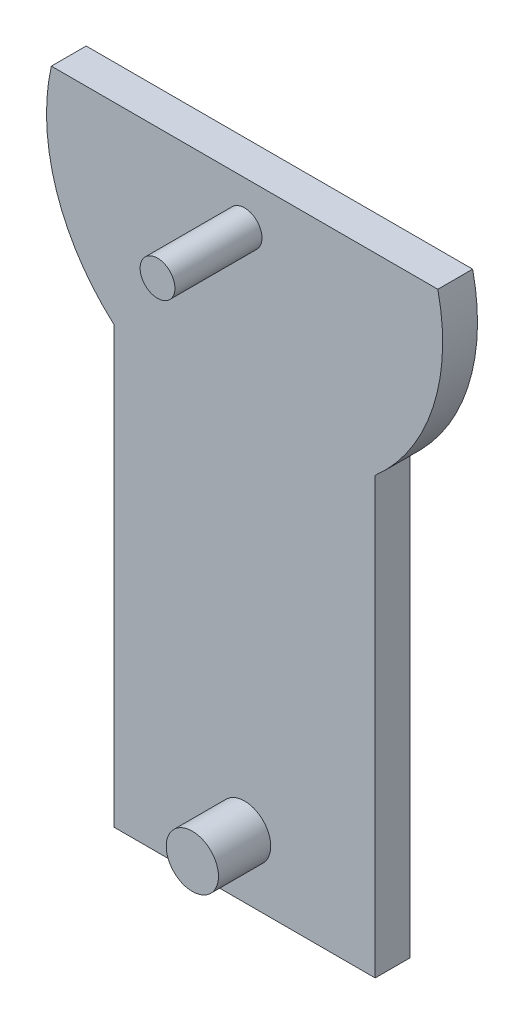
ISO-10303-21;
HEADER;
FILE_DESCRIPTION(('STEP AP214'),'2;1');
FILE_NAME('part.step','',(''),(''),'','','');
FILE_SCHEMA(('AUTOMOTIVE_DESIGN { 1 0 10303 214 1 1 1 1 }'));
ENDSEC;
DATA;
#1=APPLICATION_CONTEXT('core data for automotive mechanical design processes');
#2=APPLICATION_PROTOCOL_DEFINITION('international standard','automotive_design',2000,#1);
#3=PRODUCT_CONTEXT('',#1,'mechanical');
#4=PRODUCT('Part','Part','',(#3));
#5=PRODUCT_RELATED_PRODUCT_CATEGORY('part','',(#4));
#6=PRODUCT_DEFINITION_FORMATION('','',#4);
#7=PRODUCT_DEFINITION_CONTEXT('part definition',#1,'design');
#8=PRODUCT_DEFINITION('design','',#6,#7);
#9=PRODUCT_DEFINITION_SHAPE('','',#8);
#10=(LENGTH_UNIT() NAMED_UNIT(*) SI_UNIT(.MILLI.,.METRE.));
#11=(NAMED_UNIT(*) PLANE_ANGLE_UNIT() SI_UNIT($,.RADIAN.));
#12=(NAMED_UNIT(*) SI_UNIT($,.STERADIAN.) SOLID_ANGLE_UNIT());
#13=UNCERTAINTY_MEASURE_WITH_UNIT(LENGTH_MEASURE(1.E-05),#10,'distance_accuracy_value','');
#14=(GEOMETRIC_REPRESENTATION_CONTEXT(3) GLOBAL_UNCERTAINTY_ASSIGNED_CONTEXT((#13)) GLOBAL_UNIT_ASSIGNED_CONTEXT((#10,
#11,#12)) REPRESENTATION_CONTEXT('',''));
#15=CARTESIAN_POINT('',(0.,0.,0.));
#16=DIRECTION('',(0.,0.,1.));
#17=DIRECTION('',(1.,0.,0.));
#18=AXIS2_PLACEMENT_3D('',#15,#16,#17);
#19=CARTESIAN_POINT('',(75.,0.,20.));
#20=DIRECTION('',(-1.,0.,0.));
#21=DIRECTION('',(0.,-1.,0.));
#22=AXIS2_PLACEMENT_3D('',#19,#20,#21);
#23=PLANE('',#22);
#24=DIRECTION('',(0.,1.,0.));
#25=VECTOR('',#24,1.);
#26=CARTESIAN_POINT('',(75.,0.,0.));
#27=LINE('',#26,#25);
#28=CARTESIAN_POINT('',(75.,-335.522292415487,0.));
#29=VERTEX_POINT('',#28);
#30=CARTESIAN_POINT('',(75.,-85.5222924154866,0.));
#31=VERTEX_POINT('',#30);
#32=EDGE_CURVE('E121',#29,#31,#27,.T.);
#33=ORIENTED_EDGE('',*,*,#32,.T.);
#34=DIRECTION('',(0.,0.,-1.));
#35=VECTOR('',#34,1.);
#36=CARTESIAN_POINT('',(75.,-85.5222924154866,20.));
#37=LINE('',#36,#35);
#38=CARTESIAN_POINT('',(75.,-85.5222924154866,20.));
#39=VERTEX_POINT('',#38);
#40=EDGE_CURVE('E11',#39,#31,#37,.T.);
#41=ORIENTED_EDGE('',*,*,#40,.F.);
#42=DIRECTION('',(0.,1.,0.));
#43=VECTOR('',#42,1.);
#44=CARTESIAN_POINT('',(75.,0.,20.));
#45=LINE('',#44,#43);
#46=CARTESIAN_POINT('',(75.,-335.522292415487,20.));
#47=VERTEX_POINT('',#46);
#48=EDGE_CURVE('E136',#47,#39,#45,.T.);
#49=ORIENTED_EDGE('',*,*,#48,.F.);
#50=DIRECTION('',(0.,0.,-1.));
#51=VECTOR('',#50,1.);
#52=CARTESIAN_POINT('',(75.,-335.522292415487,20.));
#53=LINE('',#52,#51);
#54=EDGE_CURVE('E53',#47,#29,#53,.T.);
#55=ORIENTED_EDGE('',*,*,#54,.T.);
#56=EDGE_LOOP('',(#33,#41,#49,#55));
#57=FACE_BOUND('',#56,.T.);
#58=ADVANCED_FACE('F37',(#57),#23,.F.);
#59=CARTESIAN_POINT('',(0.,0.,20.));
#60=DIRECTION('',(0.,0.,-1.));
#61=DIRECTION('',(-1.,0.,0.));
#62=AXIS2_PLACEMENT_3D('',#59,#60,#61);
#63=CYLINDRICAL_SURFACE('',#62,113.75);
#64=CARTESIAN_POINT('',(0.,0.,0.));
#65=DIRECTION('',(0.,0.,1.));
#66=DIRECTION('',(1.,0.,0.));
#67=AXIS2_PLACEMENT_3D('',#64,#65,#66);
#68=CIRCLE('',#67,113.75);
#69=CARTESIAN_POINT('',(110.968745599831,25.,0.));
#70=VERTEX_POINT('',#69);
#71=EDGE_CURVE('E123',#31,#70,#68,.T.);
#72=ORIENTED_EDGE('',*,*,#71,.T.);
#73=DIRECTION('',(0.,0.,-1.));
#74=VECTOR('',#73,1.);
#75=CARTESIAN_POINT('',(110.968745599831,25.,20.));
#76=LINE('',#75,#74);
#77=CARTESIAN_POINT('',(110.968745599831,25.,20.));
#78=VERTEX_POINT('',#77);
#79=EDGE_CURVE('E45',#78,#70,#76,.T.);
#80=ORIENTED_EDGE('',*,*,#79,.F.);
#81=CARTESIAN_POINT('',(0.,0.,20.));
#82=DIRECTION('',(0.,0.,1.));
#83=DIRECTION('',(1.,0.,0.));
#84=AXIS2_PLACEMENT_3D('',#81,#82,#83);
#85=CIRCLE('',#84,113.75);
#86=EDGE_CURVE('E85',#39,#78,#85,.T.);
#87=ORIENTED_EDGE('',*,*,#86,.F.);
#88=ORIENTED_EDGE('',*,*,#40,.T.);
#89=EDGE_LOOP('',(#72,#80,#87,#88));
#90=FACE_BOUND('',#89,.T.);
#91=ADVANCED_FACE('F142',(#90),#63,.T.);
#92=CARTESIAN_POINT('',(0.,25.,20.));
#93=DIRECTION('',(0.,1.,0.));
#94=DIRECTION('',(-1.,0.,0.));
#95=AXIS2_PLACEMENT_3D('',#92,#93,#94);
#96=PLANE('',#95);
#97=DIRECTION('',(1.,0.,0.));
#98=VECTOR('',#97,1.);
#99=CARTESIAN_POINT('',(0.,25.,0.));
#100=LINE('',#99,#98);
#101=CARTESIAN_POINT('',(-110.968745599831,25.,0.));
#102=VERTEX_POINT('',#101);
#103=EDGE_CURVE('E127',#102,#70,#100,.T.);
#104=ORIENTED_EDGE('',*,*,#103,.F.);
#105=DIRECTION('',(0.,0.,-1.));
#106=VECTOR('',#105,1.);
#107=CARTESIAN_POINT('',(-110.968745599831,25.,20.));
#108=LINE('',#107,#106);
#109=CARTESIAN_POINT('',(-110.968745599831,25.,20.));
#110=VERTEX_POINT('',#109);
#111=EDGE_CURVE('E113',#110,#102,#108,.T.);
#112=ORIENTED_EDGE('',*,*,#111,.F.);
#113=DIRECTION('',(1.,0.,0.));
#114=VECTOR('',#113,1.);
#115=CARTESIAN_POINT('',(0.,25.,20.));
#116=LINE('',#115,#114);
#117=EDGE_CURVE('E103',#110,#78,#116,.T.);
#118=ORIENTED_EDGE('',*,*,#117,.T.);
#119=ORIENTED_EDGE('',*,*,#79,.T.);
#120=EDGE_LOOP('',(#104,#112,#118,#119));
#121=FACE_BOUND('',#120,.T.);
#122=ADVANCED_FACE('F141',(#121),#96,.T.);
#123=CARTESIAN_POINT('',(0.,0.,20.));
#124=DIRECTION('',(0.,0.,-1.));
#125=DIRECTION('',(-1.,0.,0.));
#126=AXIS2_PLACEMENT_3D('',#123,#124,#125);
#127=CYLINDRICAL_SURFACE('',#126,113.75);
#128=CARTESIAN_POINT('',(0.,0.,0.));
#129=DIRECTION('',(0.,0.,1.));
#130=DIRECTION('',(1.,0.,0.));
#131=AXIS2_PLACEMENT_3D('',#128,#129,#130);
#132=CIRCLE('',#131,113.75);
#133=CARTESIAN_POINT('',(-75.,-85.5222924154866,0.));
#134=VERTEX_POINT('',#133);
#135=EDGE_CURVE('E110',#102,#134,#132,.T.);
#136=ORIENTED_EDGE('',*,*,#135,.T.);
#137=DIRECTION('',(0.,0.,-1.));
#138=VECTOR('',#137,1.);
#139=CARTESIAN_POINT('',(-75.,-85.5222924154866,20.));
#140=LINE('',#139,#138);
#141=CARTESIAN_POINT('',(-75.,-85.5222924154866,20.));
#142=VERTEX_POINT('',#141);
#143=EDGE_CURVE('E107',#142,#134,#140,.T.);
#144=ORIENTED_EDGE('',*,*,#143,.F.);
#145=CARTESIAN_POINT('',(0.,0.,20.));
#146=DIRECTION('',(0.,0.,1.));
#147=DIRECTION('',(1.,0.,0.));
#148=AXIS2_PLACEMENT_3D('',#145,#146,#147);
#149=CIRCLE('',#148,113.75);
#150=EDGE_CURVE('E96',#110,#142,#149,.T.);
#151=ORIENTED_EDGE('',*,*,#150,.F.);
#152=ORIENTED_EDGE('',*,*,#111,.T.);
#153=EDGE_LOOP('',(#136,#144,#151,#152));
#154=FACE_BOUND('',#153,.T.);
#155=ADVANCED_FACE('F108',(#154),#127,.T.);
#156=CARTESIAN_POINT('',(-75.,0.,20.));
#157=DIRECTION('',(-1.,0.,0.));
#158=DIRECTION('',(0.,-1.,0.));
#159=AXIS2_PLACEMENT_3D('',#156,#157,#158);
#160=PLANE('',#159);
#161=DIRECTION('',(0.,1.,0.));
#162=VECTOR('',#161,1.);
#163=CARTESIAN_POINT('',(-75.,0.,0.));
#164=LINE('',#163,#162);
#165=CARTESIAN_POINT('',(-75.,-335.522292415487,0.));
#166=VERTEX_POINT('',#165);
#167=EDGE_CURVE('E131',#166,#134,#164,.T.);
#168=ORIENTED_EDGE('',*,*,#167,.F.);
#169=DIRECTION('',(0.,0.,-1.));
#170=VECTOR('',#169,1.);
#171=CARTESIAN_POINT('',(-75.,-335.522292415487,20.));
#172=LINE('',#171,#170);
#173=CARTESIAN_POINT('',(-75.,-335.522292415487,20.));
#174=VERTEX_POINT('',#173);
#175=EDGE_CURVE('E73',#174,#166,#172,.T.);
#176=ORIENTED_EDGE('',*,*,#175,.F.);
#177=DIRECTION('',(0.,1.,0.));
#178=VECTOR('',#177,1.);
#179=CARTESIAN_POINT('',(-75.,0.,20.));
#180=LINE('',#179,#178);
#181=EDGE_CURVE('E101',#174,#142,#180,.T.);
#182=ORIENTED_EDGE('',*,*,#181,.T.);
#183=ORIENTED_EDGE('',*,*,#143,.T.);
#184=EDGE_LOOP('',(#168,#176,#182,#183));
#185=FACE_BOUND('',#184,.T.);
#186=ADVANCED_FACE('F115',(#185),#160,.T.);
#187=CARTESIAN_POINT('',(0.,-335.522292415487,20.));
#188=DIRECTION('',(0.,-1.,0.));
#189=DIRECTION('',(0.,0.,-1.));
#190=AXIS2_PLACEMENT_3D('',#187,#188,#189);
#191=PLANE('',#190);
#192=DIRECTION('',(-1.,0.,0.));
#193=VECTOR('',#192,1.);
#194=CARTESIAN_POINT('',(0.,-335.522292415487,0.));
#195=LINE('',#194,#193);
#196=EDGE_CURVE('E133',#29,#166,#195,.T.);
#197=ORIENTED_EDGE('',*,*,#196,.F.);
#198=ORIENTED_EDGE('',*,*,#54,.F.);
#199=DIRECTION('',(-1.,0.,0.));
#200=VECTOR('',#199,1.);
#201=CARTESIAN_POINT('',(0.,-335.522292415487,20.));
#202=LINE('',#201,#200);
#203=EDGE_CURVE('E116',#47,#174,#202,.T.);
#204=ORIENTED_EDGE('',*,*,#203,.T.);
#205=ORIENTED_EDGE('',*,*,#175,.T.);
#206=EDGE_LOOP('',(#197,#198,#204,#205));
#207=FACE_BOUND('',#206,.T.);
#208=ADVANCED_FACE('F146',(#207),#191,.T.);
#209=CARTESIAN_POINT('',(0.,0.,20.));
#210=DIRECTION('',(0.,0.,1.));
#211=DIRECTION('',(1.,0.,0.));
#212=AXIS2_PLACEMENT_3D('',#209,#210,#211);
#213=PLANE('',#212);
#214=CARTESIAN_POINT('',(0.,-300.,20.));
#215=DIRECTION('',(0.,0.,1.));
#216=DIRECTION('',(1.,0.,0.));
#217=AXIS2_PLACEMENT_3D('',#214,#215,#216);
#218=CIRCLE('',#217,15.);
#219=CARTESIAN_POINT('',(15.,-300.,20.));
#220=VERTEX_POINT('',#219);
#221=EDGE_CURVE('E170',#220,#220,#218,.T.);
#222=ORIENTED_EDGE('',*,*,#221,.F.);
#223=EDGE_LOOP('',(#222));
#224=FACE_BOUND('',#223,.T.);
#225=CARTESIAN_POINT('',(0.,0.,20.));
#226=DIRECTION('',(0.,0.,1.));
#227=DIRECTION('',(1.,0.,0.));
#228=AXIS2_PLACEMENT_3D('',#225,#226,#227);
#229=CIRCLE('',#228,10.);
#230=CARTESIAN_POINT('',(10.,0.,20.));
#231=VERTEX_POINT('',#230);
#232=EDGE_CURVE('E166',#231,#231,#229,.T.);
#233=ORIENTED_EDGE('',*,*,#232,.F.);
#234=EDGE_LOOP('',(#233));
#235=FACE_BOUND('',#234,.T.);
#236=ORIENTED_EDGE('',*,*,#48,.T.);
#237=ORIENTED_EDGE('',*,*,#86,.T.);
#238=ORIENTED_EDGE('',*,*,#117,.F.);
#239=ORIENTED_EDGE('',*,*,#150,.T.);
#240=ORIENTED_EDGE('',*,*,#181,.F.);
#241=ORIENTED_EDGE('',*,*,#203,.F.);
#242=EDGE_LOOP('',(#236,#237,#238,#239,#240,#241));
#243=FACE_BOUND('',#242,.T.);
#244=ADVANCED_FACE('F98',(#224,#235,#243),#213,.T.);
#245=CARTESIAN_POINT('',(0.,0.,0.));
#246=DIRECTION('',(0.,0.,1.));
#247=DIRECTION('',(1.,0.,0.));
#248=AXIS2_PLACEMENT_3D('',#245,#246,#247);
#249=PLANE('',#248);
#250=ORIENTED_EDGE('',*,*,#32,.F.);
#251=ORIENTED_EDGE('',*,*,#196,.T.);
#252=ORIENTED_EDGE('',*,*,#167,.T.);
#253=ORIENTED_EDGE('',*,*,#135,.F.);
#254=ORIENTED_EDGE('',*,*,#103,.T.);
#255=ORIENTED_EDGE('',*,*,#71,.F.);
#256=EDGE_LOOP('',(#250,#251,#252,#253,#254,#255));
#257=FACE_BOUND('',#256,.T.);
#258=ADVANCED_FACE('F145',(#257),#249,.F.);
#259=CARTESIAN_POINT('',(0.,0.,98.2842712474619));
#260=DIRECTION('',(0.,0.,-1.));
#261=DIRECTION('',(-1.,0.,0.));
#262=AXIS2_PLACEMENT_3D('',#259,#260,#261);
#263=CYLINDRICAL_SURFACE('',#262,10.);
#264=ORIENTED_EDGE('',*,*,#232,.T.);
#265=EDGE_LOOP('',(#264));
#266=FACE_BOUND('',#265,.T.);
#267=CARTESIAN_POINT('',(0.,0.,70.));
#268=DIRECTION('',(0.,0.,1.));
#269=DIRECTION('',(1.,0.,0.));
#270=AXIS2_PLACEMENT_3D('',#267,#268,#269);
#271=CIRCLE('',#270,10.);
#272=CARTESIAN_POINT('',(10.,0.,70.));
#273=VERTEX_POINT('',#272);
#274=EDGE_CURVE('E124',#273,#273,#271,.T.);
#275=ORIENTED_EDGE('',*,*,#274,.F.);
#276=EDGE_LOOP('',(#275));
#277=FACE_BOUND('',#276,.T.);
#278=ADVANCED_FACE('F187',(#266,#277),#263,.T.);
#279=CARTESIAN_POINT('',(218.892891728432,-601.40327730298,70.));
#280=DIRECTION('',(0.,0.,1.));
#281=DIRECTION('',(-0.342020143325673,0.939692620785907,0.));
#282=AXIS2_PLACEMENT_3D('',#279,#280,#281);
#283=PLANE('',#282);
#284=ORIENTED_EDGE('',*,*,#274,.T.);
#285=EDGE_LOOP('',(#284));
#286=FACE_BOUND('',#285,.T.);
#287=ADVANCED_FACE('F181',(#286),#283,.T.);
#288=CARTESIAN_POINT('',(0.,-300.,50.));
#289=DIRECTION('',(0.,0.,-1.));
#290=DIRECTION('',(-1.,0.,0.));
#291=AXIS2_PLACEMENT_3D('',#288,#289,#290);
#292=CYLINDRICAL_SURFACE('',#291,15.);
#293=CARTESIAN_POINT('',(0.,-300.,50.));
#294=DIRECTION('',(0.,0.,1.));
#295=DIRECTION('',(1.,0.,0.));
#296=AXIS2_PLACEMENT_3D('',#293,#294,#295);
#297=CIRCLE('',#296,15.);
#298=CARTESIAN_POINT('',(15.,-300.,50.));
#299=VERTEX_POINT('',#298);
#300=EDGE_CURVE('E169',#299,#299,#297,.T.);
#301=ORIENTED_EDGE('',*,*,#300,.F.);
#302=EDGE_LOOP('',(#301));
#303=FACE_BOUND('',#302,.T.);
#304=ORIENTED_EDGE('',*,*,#221,.T.);
#305=EDGE_LOOP('',(#304));
#306=FACE_BOUND('',#305,.T.);
#307=ADVANCED_FACE('F178',(#303,#306),#292,.T.);
#308=CARTESIAN_POINT('',(0.,-300.,50.));
#309=DIRECTION('',(0.,0.,1.));
#310=DIRECTION('',(1.,0.,0.));
#311=AXIS2_PLACEMENT_3D('',#308,#309,#310);
#312=PLANE('',#311);
#313=ORIENTED_EDGE('',*,*,#300,.T.);
#314=EDGE_LOOP('',(#313));
#315=FACE_BOUND('',#314,.T.);
#316=ADVANCED_FACE('F176',(#315),#312,.T.);
#317=CLOSED_SHELL('',(#58,#91,#122,#155,#186,#208,#244,#258,#278,#287,#307,#316));
#318=MANIFOLD_SOLID_BREP('B2',#317);
#319=ADVANCED_BREP_SHAPE_REPRESENTATION('',(#18,#318),#14);
#320=SHAPE_DEFINITION_REPRESENTATION(#9,#319);
ENDSEC;
END-ISO-10303-21;
